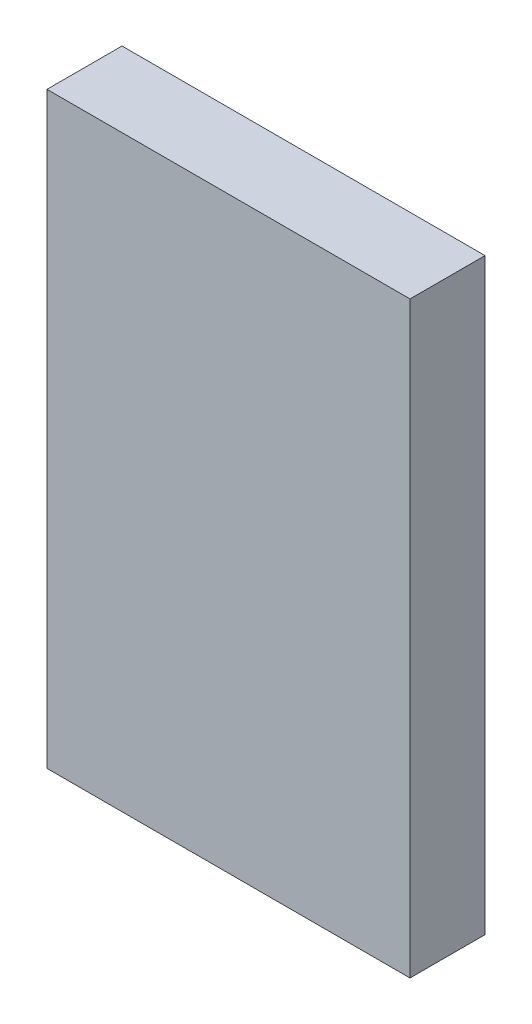
ISO-10303-21;
HEADER;
FILE_DESCRIPTION(('STEP AP214'),'2;1');
FILE_NAME('part.step','',(''),(''),'','','');
FILE_SCHEMA(('AUTOMOTIVE_DESIGN { 1 0 10303 214 1 1 1 1 }'));
ENDSEC;
DATA;
#1=APPLICATION_CONTEXT('core data for automotive mechanical design processes');
#2=APPLICATION_PROTOCOL_DEFINITION('international standard','automotive_design',2000,#1);
#3=PRODUCT_CONTEXT('',#1,'mechanical');
#4=PRODUCT('Part','Part','',(#3));
#5=PRODUCT_RELATED_PRODUCT_CATEGORY('part','',(#4));
#6=PRODUCT_DEFINITION_FORMATION('','',#4);
#7=PRODUCT_DEFINITION_CONTEXT('part definition',#1,'design');
#8=PRODUCT_DEFINITION('design','',#6,#7);
#9=PRODUCT_DEFINITION_SHAPE('','',#8);
#10=(LENGTH_UNIT() NAMED_UNIT(*) SI_UNIT(.MILLI.,.METRE.));
#11=(NAMED_UNIT(*) PLANE_ANGLE_UNIT() SI_UNIT($,.RADIAN.));
#12=(NAMED_UNIT(*) SI_UNIT($,.STERADIAN.) SOLID_ANGLE_UNIT());
#13=UNCERTAINTY_MEASURE_WITH_UNIT(LENGTH_MEASURE(1.E-05),#10,'distance_accuracy_value','');
#14=(GEOMETRIC_REPRESENTATION_CONTEXT(3) GLOBAL_UNCERTAINTY_ASSIGNED_CONTEXT((#13)) GLOBAL_UNIT_ASSIGNED_CONTEXT((#10,
#11,#12)) REPRESENTATION_CONTEXT('',''));
#15=CARTESIAN_POINT('',(0.,0.,0.));
#16=DIRECTION('',(0.,0.,1.));
#17=DIRECTION('',(1.,0.,0.));
#18=AXIS2_PLACEMENT_3D('',#15,#16,#17);
#19=CARTESIAN_POINT('',(-19.05,61.722,3.937));
#20=DIRECTION('',(1.,0.,0.));
#21=DIRECTION('',(0.,0.,-1.));
#22=AXIS2_PLACEMENT_3D('',#19,#20,#21);
#23=PLANE('',#22);
#24=DIRECTION('',(0.,0.,1.));
#25=VECTOR('',#24,1.);
#26=CARTESIAN_POINT('',(-19.05,0.,3.937));
#27=LINE('',#26,#25);
#28=CARTESIAN_POINT('',(-19.05,0.,-3.937));
#29=VERTEX_POINT('',#28);
#30=CARTESIAN_POINT('',(-19.05,0.,3.937));
#31=VERTEX_POINT('',#30);
#32=EDGE_CURVE('E107',#29,#31,#27,.T.);
#33=ORIENTED_EDGE('',*,*,#32,.T.);
#34=DIRECTION('',(0.,-1.,0.));
#35=VECTOR('',#34,1.);
#36=CARTESIAN_POINT('',(-19.05,61.722,3.937));
#37=LINE('',#36,#35);
#38=CARTESIAN_POINT('',(-19.05,61.722,3.937));
#39=VERTEX_POINT('',#38);
#40=EDGE_CURVE('E11',#39,#31,#37,.T.);
#41=ORIENTED_EDGE('',*,*,#40,.F.);
#42=DIRECTION('',(0.,0.,1.));
#43=VECTOR('',#42,1.);
#44=CARTESIAN_POINT('',(-19.05,61.722,3.937));
#45=LINE('',#44,#43);
#46=CARTESIAN_POINT('',(-19.05,61.722,-3.937));
#47=VERTEX_POINT('',#46);
#48=EDGE_CURVE('E91',#47,#39,#45,.T.);
#49=ORIENTED_EDGE('',*,*,#48,.F.);
#50=DIRECTION('',(0.,-1.,0.));
#51=VECTOR('',#50,1.);
#52=CARTESIAN_POINT('',(-19.05,61.722,-3.937));
#53=LINE('',#52,#51);
#54=EDGE_CURVE('E103',#47,#29,#53,.T.);
#55=ORIENTED_EDGE('',*,*,#54,.T.);
#56=EDGE_LOOP('',(#33,#41,#49,#55));
#57=FACE_BOUND('',#56,.T.);
#58=ADVANCED_FACE('F39',(#57),#23,.F.);
#59=CARTESIAN_POINT('',(19.05,61.722,3.937));
#60=DIRECTION('',(0.,0.,-1.));
#61=DIRECTION('',(-1.,0.,0.));
#62=AXIS2_PLACEMENT_3D('',#59,#60,#61);
#63=PLANE('',#62);
#64=DIRECTION('',(1.,0.,0.));
#65=VECTOR('',#64,1.);
#66=CARTESIAN_POINT('',(19.05,0.,3.937));
#67=LINE('',#66,#65);
#68=CARTESIAN_POINT('',(19.05,0.,3.937));
#69=VERTEX_POINT('',#68);
#70=EDGE_CURVE('E96',#31,#69,#67,.T.);
#71=ORIENTED_EDGE('',*,*,#70,.T.);
#72=DIRECTION('',(0.,-1.,0.));
#73=VECTOR('',#72,1.);
#74=CARTESIAN_POINT('',(19.05,61.722,3.937));
#75=LINE('',#74,#73);
#76=CARTESIAN_POINT('',(19.05,61.722,3.937));
#77=VERTEX_POINT('',#76);
#78=EDGE_CURVE('E48',#77,#69,#75,.T.);
#79=ORIENTED_EDGE('',*,*,#78,.F.);
#80=DIRECTION('',(1.,0.,0.));
#81=VECTOR('',#80,1.);
#82=CARTESIAN_POINT('',(19.05,61.722,3.937));
#83=LINE('',#82,#81);
#84=EDGE_CURVE('E86',#39,#77,#83,.T.);
#85=ORIENTED_EDGE('',*,*,#84,.F.);
#86=ORIENTED_EDGE('',*,*,#40,.T.);
#87=EDGE_LOOP('',(#71,#79,#85,#86));
#88=FACE_BOUND('',#87,.T.);
#89=ADVANCED_FACE('F95',(#88),#63,.F.);
#90=CARTESIAN_POINT('',(19.05,61.722,3.937));
#91=DIRECTION('',(-1.,0.,0.));
#92=DIRECTION('',(0.,0.,1.));
#93=AXIS2_PLACEMENT_3D('',#90,#91,#92);
#94=PLANE('',#93);
#95=DIRECTION('',(0.,0.,-1.));
#96=VECTOR('',#95,1.);
#97=CARTESIAN_POINT('',(19.05,0.,3.937));
#98=LINE('',#97,#96);
#99=CARTESIAN_POINT('',(19.05,0.,-3.937));
#100=VERTEX_POINT('',#99);
#101=EDGE_CURVE('E73',#69,#100,#98,.T.);
#102=ORIENTED_EDGE('',*,*,#101,.T.);
#103=DIRECTION('',(0.,-1.,0.));
#104=VECTOR('',#103,1.);
#105=CARTESIAN_POINT('',(19.05,61.722,-3.937));
#106=LINE('',#105,#104);
#107=CARTESIAN_POINT('',(19.05,61.722,-3.937));
#108=VERTEX_POINT('',#107);
#109=EDGE_CURVE('E98',#108,#100,#106,.T.);
#110=ORIENTED_EDGE('',*,*,#109,.F.);
#111=DIRECTION('',(0.,0.,-1.));
#112=VECTOR('',#111,1.);
#113=CARTESIAN_POINT('',(19.05,61.722,3.937));
#114=LINE('',#113,#112);
#115=EDGE_CURVE('E89',#77,#108,#114,.T.);
#116=ORIENTED_EDGE('',*,*,#115,.F.);
#117=ORIENTED_EDGE('',*,*,#78,.T.);
#118=EDGE_LOOP('',(#102,#110,#116,#117));
#119=FACE_BOUND('',#118,.T.);
#120=ADVANCED_FACE('F99',(#119),#94,.F.);
#121=CARTESIAN_POINT('',(19.05,61.722,-3.937));
#122=DIRECTION('',(0.,0.,1.));
#123=DIRECTION('',(1.,0.,0.));
#124=AXIS2_PLACEMENT_3D('',#121,#122,#123);
#125=PLANE('',#124);
#126=DIRECTION('',(-1.,0.,0.));
#127=VECTOR('',#126,1.);
#128=CARTESIAN_POINT('',(19.05,0.,-3.937));
#129=LINE('',#128,#127);
#130=EDGE_CURVE('E79',#100,#29,#129,.T.);
#131=ORIENTED_EDGE('',*,*,#130,.T.);
#132=ORIENTED_EDGE('',*,*,#54,.F.);
#133=DIRECTION('',(-1.,0.,0.));
#134=VECTOR('',#133,1.);
#135=CARTESIAN_POINT('',(19.05,61.722,-3.937));
#136=LINE('',#135,#134);
#137=EDGE_CURVE('E56',#108,#47,#136,.T.);
#138=ORIENTED_EDGE('',*,*,#137,.F.);
#139=ORIENTED_EDGE('',*,*,#109,.T.);
#140=EDGE_LOOP('',(#131,#132,#138,#139));
#141=FACE_BOUND('',#140,.T.);
#142=ADVANCED_FACE('F120',(#141),#125,.F.);
#143=CARTESIAN_POINT('',(0.,61.722,0.));
#144=DIRECTION('',(0.,1.,0.));
#145=DIRECTION('',(0.,0.,1.));
#146=AXIS2_PLACEMENT_3D('',#143,#144,#145);
#147=PLANE('',#146);
#148=ORIENTED_EDGE('',*,*,#48,.T.);
#149=ORIENTED_EDGE('',*,*,#84,.T.);
#150=ORIENTED_EDGE('',*,*,#115,.T.);
#151=ORIENTED_EDGE('',*,*,#137,.T.);
#152=EDGE_LOOP('',(#148,#149,#150,#151));
#153=FACE_BOUND('',#152,.T.);
#154=ADVANCED_FACE('F87',(#153),#147,.T.);
#155=CARTESIAN_POINT('',(0.,0.,0.));
#156=DIRECTION('',(0.,1.,0.));
#157=DIRECTION('',(0.,0.,1.));
#158=AXIS2_PLACEMENT_3D('',#155,#156,#157);
#159=PLANE('',#158);
#160=ORIENTED_EDGE('',*,*,#32,.F.);
#161=ORIENTED_EDGE('',*,*,#130,.F.);
#162=ORIENTED_EDGE('',*,*,#101,.F.);
#163=ORIENTED_EDGE('',*,*,#70,.F.);
#164=EDGE_LOOP('',(#160,#161,#162,#163));
#165=FACE_BOUND('',#164,.T.);
#166=ADVANCED_FACE('F123',(#165),#159,.F.);
#167=CLOSED_SHELL('',(#58,#89,#120,#142,#154,#166));
#168=MANIFOLD_SOLID_BREP('B2',#167);
#169=ADVANCED_BREP_SHAPE_REPRESENTATION('',(#18,#168),#14);
#170=SHAPE_DEFINITION_REPRESENTATION(#9,#169);
ENDSEC;
END-ISO-10303-21;
